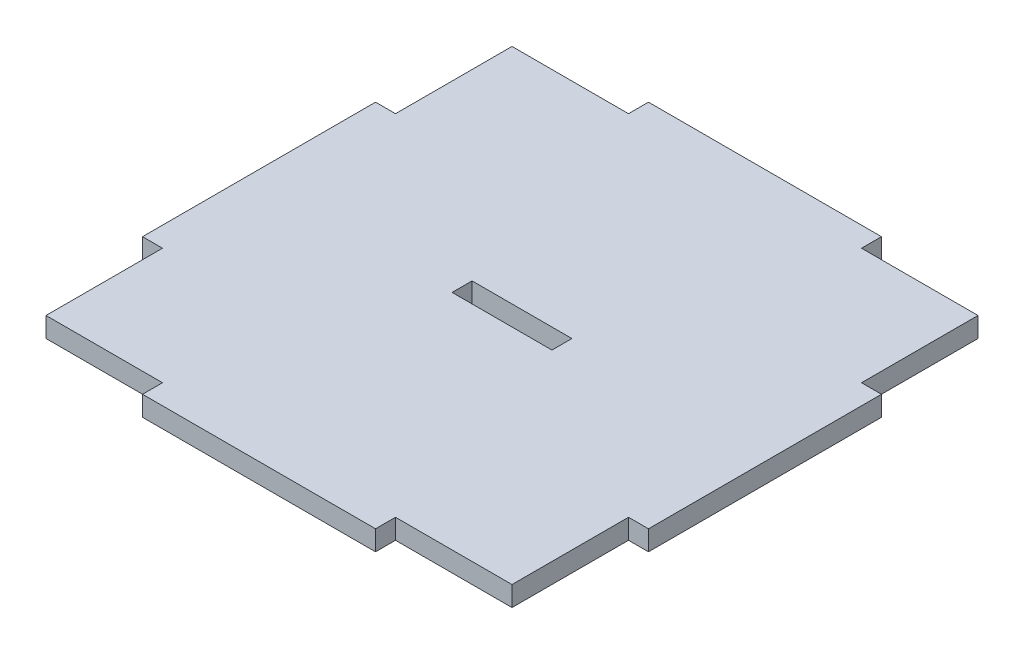
ISO-10303-21;
HEADER;
FILE_DESCRIPTION(('STEP AP214'),'2;1');
FILE_NAME('part.step','',(''),(''),'','','');
FILE_SCHEMA(('AUTOMOTIVE_DESIGN { 1 0 10303 214 1 1 1 1 }'));
ENDSEC;
DATA;
#1=APPLICATION_CONTEXT('core data for automotive mechanical design processes');
#2=APPLICATION_PROTOCOL_DEFINITION('international standard','automotive_design',2000,#1);
#3=PRODUCT_CONTEXT('',#1,'mechanical');
#4=PRODUCT('Part','Part','',(#3));
#5=PRODUCT_RELATED_PRODUCT_CATEGORY('part','',(#4));
#6=PRODUCT_DEFINITION_FORMATION('','',#4);
#7=PRODUCT_DEFINITION_CONTEXT('part definition',#1,'design');
#8=PRODUCT_DEFINITION('design','',#6,#7);
#9=PRODUCT_DEFINITION_SHAPE('','',#8);
#10=(LENGTH_UNIT() NAMED_UNIT(*) SI_UNIT(.MILLI.,.METRE.));
#11=(NAMED_UNIT(*) PLANE_ANGLE_UNIT() SI_UNIT($,.RADIAN.));
#12=(NAMED_UNIT(*) SI_UNIT($,.STERADIAN.) SOLID_ANGLE_UNIT());
#13=UNCERTAINTY_MEASURE_WITH_UNIT(LENGTH_MEASURE(1.E-05),#10,'distance_accuracy_value','');
#14=(GEOMETRIC_REPRESENTATION_CONTEXT(3) GLOBAL_UNCERTAINTY_ASSIGNED_CONTEXT((#13)) GLOBAL_UNIT_ASSIGNED_CONTEXT((#10,
#11,#12)) REPRESENTATION_CONTEXT('',''));
#15=CARTESIAN_POINT('',(0.,0.,0.));
#16=DIRECTION('',(0.,0.,1.));
#17=DIRECTION('',(1.,0.,0.));
#18=AXIS2_PLACEMENT_3D('',#15,#16,#17);
#19=CARTESIAN_POINT('',(35.,3.,-17.5));
#20=DIRECTION('',(-1.,0.,0.));
#21=DIRECTION('',(0.,0.,1.));
#22=AXIS2_PLACEMENT_3D('',#19,#20,#21);
#23=PLANE('',#22);
#24=DIRECTION('',(0.,0.,-1.));
#25=VECTOR('',#24,1.);
#26=CARTESIAN_POINT('',(35.,0.,-17.5));
#27=LINE('',#26,#25);
#28=CARTESIAN_POINT('',(35.,0.,-17.5));
#29=VERTEX_POINT('',#28);
#30=CARTESIAN_POINT('',(35.,0.,-35.));
#31=VERTEX_POINT('',#30);
#32=EDGE_CURVE('E243',#29,#31,#27,.T.);
#33=ORIENTED_EDGE('',*,*,#32,.T.);
#34=DIRECTION('',(0.,-1.,0.));
#35=VECTOR('',#34,1.);
#36=CARTESIAN_POINT('',(35.,3.,-35.));
#37=LINE('',#36,#35);
#38=CARTESIAN_POINT('',(35.,3.,-35.));
#39=VERTEX_POINT('',#38);
#40=EDGE_CURVE('E11',#39,#31,#37,.T.);
#41=ORIENTED_EDGE('',*,*,#40,.F.);
#42=DIRECTION('',(0.,0.,-1.));
#43=VECTOR('',#42,1.);
#44=CARTESIAN_POINT('',(35.,3.,-17.5));
#45=LINE('',#44,#43);
#46=CARTESIAN_POINT('',(35.,3.,-17.5));
#47=VERTEX_POINT('',#46);
#48=EDGE_CURVE('E249',#47,#39,#45,.T.);
#49=ORIENTED_EDGE('',*,*,#48,.F.);
#50=DIRECTION('',(0.,-1.,0.));
#51=VECTOR('',#50,1.);
#52=CARTESIAN_POINT('',(35.,3.,-17.5));
#53=LINE('',#52,#51);
#54=EDGE_CURVE('E311',#47,#29,#53,.T.);
#55=ORIENTED_EDGE('',*,*,#54,.T.);
#56=EDGE_LOOP('',(#33,#41,#49,#55));
#57=FACE_BOUND('',#56,.T.);
#58=ADVANCED_FACE('F39',(#57),#23,.F.);
#59=CARTESIAN_POINT('',(17.5,3.,-35.));
#60=DIRECTION('',(0.,0.,1.));
#61=DIRECTION('',(1.,0.,0.));
#62=AXIS2_PLACEMENT_3D('',#59,#60,#61);
#63=PLANE('',#62);
#64=DIRECTION('',(-1.,0.,0.));
#65=VECTOR('',#64,1.);
#66=CARTESIAN_POINT('',(17.5,0.,-35.));
#67=LINE('',#66,#65);
#68=CARTESIAN_POINT('',(17.5,0.,-35.));
#69=VERTEX_POINT('',#68);
#70=EDGE_CURVE('E315',#31,#69,#67,.T.);
#71=ORIENTED_EDGE('',*,*,#70,.T.);
#72=DIRECTION('',(0.,-1.,0.));
#73=VECTOR('',#72,1.);
#74=CARTESIAN_POINT('',(17.5,3.,-35.));
#75=LINE('',#74,#73);
#76=CARTESIAN_POINT('',(17.5,3.,-35.));
#77=VERTEX_POINT('',#76);
#78=EDGE_CURVE('E47',#77,#69,#75,.T.);
#79=ORIENTED_EDGE('',*,*,#78,.F.);
#80=DIRECTION('',(-1.,0.,0.));
#81=VECTOR('',#80,1.);
#82=CARTESIAN_POINT('',(17.5,3.,-35.));
#83=LINE('',#82,#81);
#84=EDGE_CURVE('E253',#39,#77,#83,.T.);
#85=ORIENTED_EDGE('',*,*,#84,.F.);
#86=ORIENTED_EDGE('',*,*,#40,.T.);
#87=EDGE_LOOP('',(#71,#79,#85,#86));
#88=FACE_BOUND('',#87,.T.);
#89=ADVANCED_FACE('F468',(#88),#63,.F.);
#90=CARTESIAN_POINT('',(17.5,3.,-38.));
#91=DIRECTION('',(-1.,0.,0.));
#92=DIRECTION('',(0.,0.,1.));
#93=AXIS2_PLACEMENT_3D('',#90,#91,#92);
#94=PLANE('',#93);
#95=DIRECTION('',(0.,0.,-1.));
#96=VECTOR('',#95,1.);
#97=CARTESIAN_POINT('',(17.5,0.,-38.));
#98=LINE('',#97,#96);
#99=CARTESIAN_POINT('',(17.5,0.,-38.));
#100=VERTEX_POINT('',#99);
#101=EDGE_CURVE('E318',#69,#100,#98,.T.);
#102=ORIENTED_EDGE('',*,*,#101,.T.);
#103=DIRECTION('',(0.,-1.,0.));
#104=VECTOR('',#103,1.);
#105=CARTESIAN_POINT('',(17.5,3.,-38.));
#106=LINE('',#105,#104);
#107=CARTESIAN_POINT('',(17.5,3.,-38.));
#108=VERTEX_POINT('',#107);
#109=EDGE_CURVE('E438',#108,#100,#106,.T.);
#110=ORIENTED_EDGE('',*,*,#109,.F.);
#111=DIRECTION('',(0.,0.,-1.));
#112=VECTOR('',#111,1.);
#113=CARTESIAN_POINT('',(17.5,3.,-38.));
#114=LINE('',#113,#112);
#115=EDGE_CURVE('E257',#77,#108,#114,.T.);
#116=ORIENTED_EDGE('',*,*,#115,.F.);
#117=ORIENTED_EDGE('',*,*,#78,.T.);
#118=EDGE_LOOP('',(#102,#110,#116,#117));
#119=FACE_BOUND('',#118,.T.);
#120=ADVANCED_FACE('F447',(#119),#94,.F.);
#121=CARTESIAN_POINT('',(-17.5,3.,-38.));
#122=DIRECTION('',(0.,0.,1.));
#123=DIRECTION('',(1.,0.,0.));
#124=AXIS2_PLACEMENT_3D('',#121,#122,#123);
#125=PLANE('',#124);
#126=DIRECTION('',(-1.,0.,0.));
#127=VECTOR('',#126,1.);
#128=CARTESIAN_POINT('',(-17.5,0.,-38.));
#129=LINE('',#128,#127);
#130=CARTESIAN_POINT('',(-17.5,0.,-38.));
#131=VERTEX_POINT('',#130);
#132=EDGE_CURVE('E321',#100,#131,#129,.T.);
#133=ORIENTED_EDGE('',*,*,#132,.T.);
#134=DIRECTION('',(0.,-1.,0.));
#135=VECTOR('',#134,1.);
#136=CARTESIAN_POINT('',(-17.5,3.,-38.));
#137=LINE('',#136,#135);
#138=CARTESIAN_POINT('',(-17.5,3.,-38.));
#139=VERTEX_POINT('',#138);
#140=EDGE_CURVE('E434',#139,#131,#137,.T.);
#141=ORIENTED_EDGE('',*,*,#140,.F.);
#142=DIRECTION('',(-1.,0.,0.));
#143=VECTOR('',#142,1.);
#144=CARTESIAN_POINT('',(-17.5,3.,-38.));
#145=LINE('',#144,#143);
#146=EDGE_CURVE('E260',#108,#139,#145,.T.);
#147=ORIENTED_EDGE('',*,*,#146,.F.);
#148=ORIENTED_EDGE('',*,*,#109,.T.);
#149=EDGE_LOOP('',(#133,#141,#147,#148));
#150=FACE_BOUND('',#149,.T.);
#151=ADVANCED_FACE('F456',(#150),#125,.F.);
#152=CARTESIAN_POINT('',(-17.5,3.,-38.));
#153=DIRECTION('',(1.,0.,0.));
#154=DIRECTION('',(0.,0.,-1.));
#155=AXIS2_PLACEMENT_3D('',#152,#153,#154);
#156=PLANE('',#155);
#157=DIRECTION('',(0.,0.,1.));
#158=VECTOR('',#157,1.);
#159=CARTESIAN_POINT('',(-17.5,0.,-38.));
#160=LINE('',#159,#158);
#161=CARTESIAN_POINT('',(-17.5,0.,-35.));
#162=VERTEX_POINT('',#161);
#163=EDGE_CURVE('E324',#131,#162,#160,.T.);
#164=ORIENTED_EDGE('',*,*,#163,.T.);
#165=DIRECTION('',(0.,-1.,0.));
#166=VECTOR('',#165,1.);
#167=CARTESIAN_POINT('',(-17.5,3.,-35.));
#168=LINE('',#167,#166);
#169=CARTESIAN_POINT('',(-17.5,3.,-35.));
#170=VERTEX_POINT('',#169);
#171=EDGE_CURVE('E430',#170,#162,#168,.T.);
#172=ORIENTED_EDGE('',*,*,#171,.F.);
#173=DIRECTION('',(0.,0.,1.));
#174=VECTOR('',#173,1.);
#175=CARTESIAN_POINT('',(-17.5,3.,-38.));
#176=LINE('',#175,#174);
#177=EDGE_CURVE('E263',#139,#170,#176,.T.);
#178=ORIENTED_EDGE('',*,*,#177,.F.);
#179=ORIENTED_EDGE('',*,*,#140,.T.);
#180=EDGE_LOOP('',(#164,#172,#178,#179));
#181=FACE_BOUND('',#180,.T.);
#182=ADVANCED_FACE('F460',(#181),#156,.F.);
#183=CARTESIAN_POINT('',(-35.,3.,-35.));
#184=DIRECTION('',(0.,0.,1.));
#185=DIRECTION('',(1.,0.,0.));
#186=AXIS2_PLACEMENT_3D('',#183,#184,#185);
#187=PLANE('',#186);
#188=DIRECTION('',(-1.,0.,0.));
#189=VECTOR('',#188,1.);
#190=CARTESIAN_POINT('',(-35.,0.,-35.));
#191=LINE('',#190,#189);
#192=CARTESIAN_POINT('',(-35.,0.,-35.));
#193=VERTEX_POINT('',#192);
#194=EDGE_CURVE('E327',#162,#193,#191,.T.);
#195=ORIENTED_EDGE('',*,*,#194,.T.);
#196=DIRECTION('',(0.,-1.,0.));
#197=VECTOR('',#196,1.);
#198=CARTESIAN_POINT('',(-35.,3.,-35.));
#199=LINE('',#198,#197);
#200=CARTESIAN_POINT('',(-35.,3.,-35.));
#201=VERTEX_POINT('',#200);
#202=EDGE_CURVE('E426',#201,#193,#199,.T.);
#203=ORIENTED_EDGE('',*,*,#202,.F.);
#204=DIRECTION('',(-1.,0.,0.));
#205=VECTOR('',#204,1.);
#206=CARTESIAN_POINT('',(-35.,3.,-35.));
#207=LINE('',#206,#205);
#208=EDGE_CURVE('E266',#170,#201,#207,.T.);
#209=ORIENTED_EDGE('',*,*,#208,.F.);
#210=ORIENTED_EDGE('',*,*,#171,.T.);
#211=EDGE_LOOP('',(#195,#203,#209,#210));
#212=FACE_BOUND('',#211,.T.);
#213=ADVANCED_FACE('F541',(#212),#187,.F.);
#214=CARTESIAN_POINT('',(-35.,3.,-17.5));
#215=DIRECTION('',(1.,0.,0.));
#216=DIRECTION('',(0.,0.,-1.));
#217=AXIS2_PLACEMENT_3D('',#214,#215,#216);
#218=PLANE('',#217);
#219=DIRECTION('',(0.,0.,1.));
#220=VECTOR('',#219,1.);
#221=CARTESIAN_POINT('',(-35.,0.,-17.5));
#222=LINE('',#221,#220);
#223=CARTESIAN_POINT('',(-35.,0.,-17.5));
#224=VERTEX_POINT('',#223);
#225=EDGE_CURVE('E330',#193,#224,#222,.T.);
#226=ORIENTED_EDGE('',*,*,#225,.T.);
#227=DIRECTION('',(0.,-1.,0.));
#228=VECTOR('',#227,1.);
#229=CARTESIAN_POINT('',(-35.,3.,-17.5));
#230=LINE('',#229,#228);
#231=CARTESIAN_POINT('',(-35.,3.,-17.5));
#232=VERTEX_POINT('',#231);
#233=EDGE_CURVE('E422',#232,#224,#230,.T.);
#234=ORIENTED_EDGE('',*,*,#233,.F.);
#235=DIRECTION('',(0.,0.,1.));
#236=VECTOR('',#235,1.);
#237=CARTESIAN_POINT('',(-35.,3.,-17.5));
#238=LINE('',#237,#236);
#239=EDGE_CURVE('E269',#201,#232,#238,.T.);
#240=ORIENTED_EDGE('',*,*,#239,.F.);
#241=ORIENTED_EDGE('',*,*,#202,.T.);
#242=EDGE_LOOP('',(#226,#234,#240,#241));
#243=FACE_BOUND('',#242,.T.);
#244=ADVANCED_FACE('F539',(#243),#218,.F.);
#245=CARTESIAN_POINT('',(-38.,3.,-17.5));
#246=DIRECTION('',(0.,0.,1.));
#247=DIRECTION('',(1.,0.,0.));
#248=AXIS2_PLACEMENT_3D('',#245,#246,#247);
#249=PLANE('',#248);
#250=DIRECTION('',(-1.,0.,0.));
#251=VECTOR('',#250,1.);
#252=CARTESIAN_POINT('',(-38.,0.,-17.5));
#253=LINE('',#252,#251);
#254=CARTESIAN_POINT('',(-38.,0.,-17.5));
#255=VERTEX_POINT('',#254);
#256=EDGE_CURVE('E333',#224,#255,#253,.T.);
#257=ORIENTED_EDGE('',*,*,#256,.T.);
#258=DIRECTION('',(0.,-1.,0.));
#259=VECTOR('',#258,1.);
#260=CARTESIAN_POINT('',(-38.,3.,-17.5));
#261=LINE('',#260,#259);
#262=CARTESIAN_POINT('',(-38.,3.,-17.5));
#263=VERTEX_POINT('',#262);
#264=EDGE_CURVE('E418',#263,#255,#261,.T.);
#265=ORIENTED_EDGE('',*,*,#264,.F.);
#266=DIRECTION('',(-1.,0.,0.));
#267=VECTOR('',#266,1.);
#268=CARTESIAN_POINT('',(-38.,3.,-17.5));
#269=LINE('',#268,#267);
#270=EDGE_CURVE('E272',#232,#263,#269,.T.);
#271=ORIENTED_EDGE('',*,*,#270,.F.);
#272=ORIENTED_EDGE('',*,*,#233,.T.);
#273=EDGE_LOOP('',(#257,#265,#271,#272));
#274=FACE_BOUND('',#273,.T.);
#275=ADVANCED_FACE('F534',(#274),#249,.F.);
#276=CARTESIAN_POINT('',(-38.,3.,17.5));
#277=DIRECTION('',(1.,0.,0.));
#278=DIRECTION('',(0.,0.,-1.));
#279=AXIS2_PLACEMENT_3D('',#276,#277,#278);
#280=PLANE('',#279);
#281=DIRECTION('',(0.,0.,1.));
#282=VECTOR('',#281,1.);
#283=CARTESIAN_POINT('',(-38.,0.,17.5));
#284=LINE('',#283,#282);
#285=CARTESIAN_POINT('',(-38.,0.,17.5));
#286=VERTEX_POINT('',#285);
#287=EDGE_CURVE('E336',#255,#286,#284,.T.);
#288=ORIENTED_EDGE('',*,*,#287,.T.);
#289=DIRECTION('',(0.,-1.,0.));
#290=VECTOR('',#289,1.);
#291=CARTESIAN_POINT('',(-38.,3.,17.5));
#292=LINE('',#291,#290);
#293=CARTESIAN_POINT('',(-38.,3.,17.5));
#294=VERTEX_POINT('',#293);
#295=EDGE_CURVE('E414',#294,#286,#292,.T.);
#296=ORIENTED_EDGE('',*,*,#295,.F.);
#297=DIRECTION('',(0.,0.,1.));
#298=VECTOR('',#297,1.);
#299=CARTESIAN_POINT('',(-38.,3.,17.5));
#300=LINE('',#299,#298);
#301=EDGE_CURVE('E275',#263,#294,#300,.T.);
#302=ORIENTED_EDGE('',*,*,#301,.F.);
#303=ORIENTED_EDGE('',*,*,#264,.T.);
#304=EDGE_LOOP('',(#288,#296,#302,#303));
#305=FACE_BOUND('',#304,.T.);
#306=ADVANCED_FACE('F529',(#305),#280,.F.);
#307=CARTESIAN_POINT('',(-38.,3.,17.5));
#308=DIRECTION('',(0.,0.,-1.));
#309=DIRECTION('',(-1.,0.,0.));
#310=AXIS2_PLACEMENT_3D('',#307,#308,#309);
#311=PLANE('',#310);
#312=DIRECTION('',(1.,0.,0.));
#313=VECTOR('',#312,1.);
#314=CARTESIAN_POINT('',(-38.,0.,17.5));
#315=LINE('',#314,#313);
#316=CARTESIAN_POINT('',(-35.,0.,17.5));
#317=VERTEX_POINT('',#316);
#318=EDGE_CURVE('E339',#286,#317,#315,.T.);
#319=ORIENTED_EDGE('',*,*,#318,.T.);
#320=DIRECTION('',(0.,-1.,0.));
#321=VECTOR('',#320,1.);
#322=CARTESIAN_POINT('',(-35.,3.,17.5));
#323=LINE('',#322,#321);
#324=CARTESIAN_POINT('',(-35.,3.,17.5));
#325=VERTEX_POINT('',#324);
#326=EDGE_CURVE('E410',#325,#317,#323,.T.);
#327=ORIENTED_EDGE('',*,*,#326,.F.);
#328=DIRECTION('',(1.,0.,0.));
#329=VECTOR('',#328,1.);
#330=CARTESIAN_POINT('',(-38.,3.,17.5));
#331=LINE('',#330,#329);
#332=EDGE_CURVE('E278',#294,#325,#331,.T.);
#333=ORIENTED_EDGE('',*,*,#332,.F.);
#334=ORIENTED_EDGE('',*,*,#295,.T.);
#335=EDGE_LOOP('',(#319,#327,#333,#334));
#336=FACE_BOUND('',#335,.T.);
#337=ADVANCED_FACE('F525',(#336),#311,.F.);
#338=CARTESIAN_POINT('',(-35.,3.,35.));
#339=DIRECTION('',(1.,0.,0.));
#340=DIRECTION('',(0.,0.,-1.));
#341=AXIS2_PLACEMENT_3D('',#338,#339,#340);
#342=PLANE('',#341);
#343=DIRECTION('',(0.,0.,1.));
#344=VECTOR('',#343,1.);
#345=CARTESIAN_POINT('',(-35.,0.,35.));
#346=LINE('',#345,#344);
#347=CARTESIAN_POINT('',(-35.,0.,35.));
#348=VERTEX_POINT('',#347);
#349=EDGE_CURVE('E342',#317,#348,#346,.T.);
#350=ORIENTED_EDGE('',*,*,#349,.T.);
#351=DIRECTION('',(0.,-1.,0.));
#352=VECTOR('',#351,1.);
#353=CARTESIAN_POINT('',(-35.,3.,35.));
#354=LINE('',#353,#352);
#355=CARTESIAN_POINT('',(-35.,3.,35.));
#356=VERTEX_POINT('',#355);
#357=EDGE_CURVE('E406',#356,#348,#354,.T.);
#358=ORIENTED_EDGE('',*,*,#357,.F.);
#359=DIRECTION('',(0.,0.,1.));
#360=VECTOR('',#359,1.);
#361=CARTESIAN_POINT('',(-35.,3.,35.));
#362=LINE('',#361,#360);
#363=EDGE_CURVE('E281',#325,#356,#362,.T.);
#364=ORIENTED_EDGE('',*,*,#363,.F.);
#365=ORIENTED_EDGE('',*,*,#326,.T.);
#366=EDGE_LOOP('',(#350,#358,#364,#365));
#367=FACE_BOUND('',#366,.T.);
#368=ADVANCED_FACE('F520',(#367),#342,.F.);
#369=CARTESIAN_POINT('',(-35.,3.,35.));
#370=DIRECTION('',(0.,0.,-1.));
#371=DIRECTION('',(-1.,0.,0.));
#372=AXIS2_PLACEMENT_3D('',#369,#370,#371);
#373=PLANE('',#372);
#374=DIRECTION('',(1.,0.,0.));
#375=VECTOR('',#374,1.);
#376=CARTESIAN_POINT('',(-35.,0.,35.));
#377=LINE('',#376,#375);
#378=CARTESIAN_POINT('',(-17.5,0.,35.));
#379=VERTEX_POINT('',#378);
#380=EDGE_CURVE('E345',#348,#379,#377,.T.);
#381=ORIENTED_EDGE('',*,*,#380,.T.);
#382=DIRECTION('',(0.,-1.,0.));
#383=VECTOR('',#382,1.);
#384=CARTESIAN_POINT('',(-17.5,3.,35.));
#385=LINE('',#384,#383);
#386=CARTESIAN_POINT('',(-17.5,3.,35.));
#387=VERTEX_POINT('',#386);
#388=EDGE_CURVE('E402',#387,#379,#385,.T.);
#389=ORIENTED_EDGE('',*,*,#388,.F.);
#390=DIRECTION('',(1.,0.,0.));
#391=VECTOR('',#390,1.);
#392=CARTESIAN_POINT('',(-35.,3.,35.));
#393=LINE('',#392,#391);
#394=EDGE_CURVE('E284',#356,#387,#393,.T.);
#395=ORIENTED_EDGE('',*,*,#394,.F.);
#396=ORIENTED_EDGE('',*,*,#357,.T.);
#397=EDGE_LOOP('',(#381,#389,#395,#396));
#398=FACE_BOUND('',#397,.T.);
#399=ADVANCED_FACE('F514',(#398),#373,.F.);
#400=CARTESIAN_POINT('',(-17.5,3.,38.));
#401=DIRECTION('',(1.,0.,0.));
#402=DIRECTION('',(0.,0.,-1.));
#403=AXIS2_PLACEMENT_3D('',#400,#401,#402);
#404=PLANE('',#403);
#405=DIRECTION('',(0.,0.,1.));
#406=VECTOR('',#405,1.);
#407=CARTESIAN_POINT('',(-17.5,0.,38.));
#408=LINE('',#407,#406);
#409=CARTESIAN_POINT('',(-17.5,0.,38.));
#410=VERTEX_POINT('',#409);
#411=EDGE_CURVE('E348',#379,#410,#408,.T.);
#412=ORIENTED_EDGE('',*,*,#411,.T.);
#413=DIRECTION('',(0.,-1.,0.));
#414=VECTOR('',#413,1.);
#415=CARTESIAN_POINT('',(-17.5,3.,38.));
#416=LINE('',#415,#414);
#417=CARTESIAN_POINT('',(-17.5,3.,38.));
#418=VERTEX_POINT('',#417);
#419=EDGE_CURVE('E398',#418,#410,#416,.T.);
#420=ORIENTED_EDGE('',*,*,#419,.F.);
#421=DIRECTION('',(0.,0.,1.));
#422=VECTOR('',#421,1.);
#423=CARTESIAN_POINT('',(-17.5,3.,38.));
#424=LINE('',#423,#422);
#425=EDGE_CURVE('E287',#387,#418,#424,.T.);
#426=ORIENTED_EDGE('',*,*,#425,.F.);
#427=ORIENTED_EDGE('',*,*,#388,.T.);
#428=EDGE_LOOP('',(#412,#420,#426,#427));
#429=FACE_BOUND('',#428,.T.);
#430=ADVANCED_FACE('F510',(#429),#404,.F.);
#431=CARTESIAN_POINT('',(-17.5,3.,38.));
#432=DIRECTION('',(0.,0.,-1.));
#433=DIRECTION('',(-1.,0.,0.));
#434=AXIS2_PLACEMENT_3D('',#431,#432,#433);
#435=PLANE('',#434);
#436=DIRECTION('',(1.,0.,0.));
#437=VECTOR('',#436,1.);
#438=CARTESIAN_POINT('',(-17.5,0.,38.));
#439=LINE('',#438,#437);
#440=CARTESIAN_POINT('',(17.5,0.,38.));
#441=VERTEX_POINT('',#440);
#442=EDGE_CURVE('E351',#410,#441,#439,.T.);
#443=ORIENTED_EDGE('',*,*,#442,.T.);
#444=DIRECTION('',(0.,-1.,0.));
#445=VECTOR('',#444,1.);
#446=CARTESIAN_POINT('',(17.5,3.,38.));
#447=LINE('',#446,#445);
#448=CARTESIAN_POINT('',(17.5,3.,38.));
#449=VERTEX_POINT('',#448);
#450=EDGE_CURVE('E394',#449,#441,#447,.T.);
#451=ORIENTED_EDGE('',*,*,#450,.F.);
#452=DIRECTION('',(1.,0.,0.));
#453=VECTOR('',#452,1.);
#454=CARTESIAN_POINT('',(-17.5,3.,38.));
#455=LINE('',#454,#453);
#456=EDGE_CURVE('E290',#418,#449,#455,.T.);
#457=ORIENTED_EDGE('',*,*,#456,.F.);
#458=ORIENTED_EDGE('',*,*,#419,.T.);
#459=EDGE_LOOP('',(#443,#451,#457,#458));
#460=FACE_BOUND('',#459,.T.);
#461=ADVANCED_FACE('F505',(#460),#435,.F.);
#462=CARTESIAN_POINT('',(17.5,3.,38.));
#463=DIRECTION('',(-1.,0.,0.));
#464=DIRECTION('',(0.,0.,1.));
#465=AXIS2_PLACEMENT_3D('',#462,#463,#464);
#466=PLANE('',#465);
#467=DIRECTION('',(0.,0.,-1.));
#468=VECTOR('',#467,1.);
#469=CARTESIAN_POINT('',(17.5,0.,38.));
#470=LINE('',#469,#468);
#471=CARTESIAN_POINT('',(17.5,0.,35.));
#472=VERTEX_POINT('',#471);
#473=EDGE_CURVE('E354',#441,#472,#470,.T.);
#474=ORIENTED_EDGE('',*,*,#473,.T.);
#475=DIRECTION('',(0.,-1.,0.));
#476=VECTOR('',#475,1.);
#477=CARTESIAN_POINT('',(17.5,3.,35.));
#478=LINE('',#477,#476);
#479=CARTESIAN_POINT('',(17.5,3.,35.));
#480=VERTEX_POINT('',#479);
#481=EDGE_CURVE('E390',#480,#472,#478,.T.);
#482=ORIENTED_EDGE('',*,*,#481,.F.);
#483=DIRECTION('',(0.,0.,-1.));
#484=VECTOR('',#483,1.);
#485=CARTESIAN_POINT('',(17.5,3.,38.));
#486=LINE('',#485,#484);
#487=EDGE_CURVE('E293',#449,#480,#486,.T.);
#488=ORIENTED_EDGE('',*,*,#487,.F.);
#489=ORIENTED_EDGE('',*,*,#450,.T.);
#490=EDGE_LOOP('',(#474,#482,#488,#489));
#491=FACE_BOUND('',#490,.T.);
#492=ADVANCED_FACE('F499',(#491),#466,.F.);
#493=CARTESIAN_POINT('',(17.5,3.,35.));
#494=DIRECTION('',(0.,0.,-1.));
#495=DIRECTION('',(-1.,0.,0.));
#496=AXIS2_PLACEMENT_3D('',#493,#494,#495);
#497=PLANE('',#496);
#498=DIRECTION('',(1.,0.,0.));
#499=VECTOR('',#498,1.);
#500=CARTESIAN_POINT('',(17.5,0.,35.));
#501=LINE('',#500,#499);
#502=CARTESIAN_POINT('',(35.,0.,35.));
#503=VERTEX_POINT('',#502);
#504=EDGE_CURVE('E357',#472,#503,#501,.T.);
#505=ORIENTED_EDGE('',*,*,#504,.T.);
#506=DIRECTION('',(0.,-1.,0.));
#507=VECTOR('',#506,1.);
#508=CARTESIAN_POINT('',(35.,3.,35.));
#509=LINE('',#508,#507);
#510=CARTESIAN_POINT('',(35.,3.,35.));
#511=VERTEX_POINT('',#510);
#512=EDGE_CURVE('E386',#511,#503,#509,.T.);
#513=ORIENTED_EDGE('',*,*,#512,.F.);
#514=DIRECTION('',(1.,0.,0.));
#515=VECTOR('',#514,1.);
#516=CARTESIAN_POINT('',(17.5,3.,35.));
#517=LINE('',#516,#515);
#518=EDGE_CURVE('E296',#480,#511,#517,.T.);
#519=ORIENTED_EDGE('',*,*,#518,.F.);
#520=ORIENTED_EDGE('',*,*,#481,.T.);
#521=EDGE_LOOP('',(#505,#513,#519,#520));
#522=FACE_BOUND('',#521,.T.);
#523=ADVANCED_FACE('F495',(#522),#497,.F.);
#524=CARTESIAN_POINT('',(35.,3.,35.));
#525=DIRECTION('',(-1.,0.,0.));
#526=DIRECTION('',(0.,0.,1.));
#527=AXIS2_PLACEMENT_3D('',#524,#525,#526);
#528=PLANE('',#527);
#529=DIRECTION('',(0.,0.,-1.));
#530=VECTOR('',#529,1.);
#531=CARTESIAN_POINT('',(35.,0.,35.));
#532=LINE('',#531,#530);
#533=CARTESIAN_POINT('',(35.,0.,17.5));
#534=VERTEX_POINT('',#533);
#535=EDGE_CURVE('E360',#503,#534,#532,.T.);
#536=ORIENTED_EDGE('',*,*,#535,.T.);
#537=DIRECTION('',(0.,-1.,0.));
#538=VECTOR('',#537,1.);
#539=CARTESIAN_POINT('',(35.,3.,17.5));
#540=LINE('',#539,#538);
#541=CARTESIAN_POINT('',(35.,3.,17.5));
#542=VERTEX_POINT('',#541);
#543=EDGE_CURVE('E382',#542,#534,#540,.T.);
#544=ORIENTED_EDGE('',*,*,#543,.F.);
#545=DIRECTION('',(0.,0.,-1.));
#546=VECTOR('',#545,1.);
#547=CARTESIAN_POINT('',(35.,3.,35.));
#548=LINE('',#547,#546);
#549=EDGE_CURVE('E299',#511,#542,#548,.T.);
#550=ORIENTED_EDGE('',*,*,#549,.F.);
#551=ORIENTED_EDGE('',*,*,#512,.T.);
#552=EDGE_LOOP('',(#536,#544,#550,#551));
#553=FACE_BOUND('',#552,.T.);
#554=ADVANCED_FACE('F490',(#553),#528,.F.);
#555=CARTESIAN_POINT('',(38.,3.,17.5));
#556=DIRECTION('',(0.,0.,-1.));
#557=DIRECTION('',(-1.,0.,0.));
#558=AXIS2_PLACEMENT_3D('',#555,#556,#557);
#559=PLANE('',#558);
#560=DIRECTION('',(1.,0.,0.));
#561=VECTOR('',#560,1.);
#562=CARTESIAN_POINT('',(38.,0.,17.5));
#563=LINE('',#562,#561);
#564=CARTESIAN_POINT('',(38.,0.,17.5));
#565=VERTEX_POINT('',#564);
#566=EDGE_CURVE('E363',#534,#565,#563,.T.);
#567=ORIENTED_EDGE('',*,*,#566,.T.);
#568=DIRECTION('',(0.,-1.,0.));
#569=VECTOR('',#568,1.);
#570=CARTESIAN_POINT('',(38.,3.,17.5));
#571=LINE('',#570,#569);
#572=CARTESIAN_POINT('',(38.,3.,17.5));
#573=VERTEX_POINT('',#572);
#574=EDGE_CURVE('E378',#573,#565,#571,.T.);
#575=ORIENTED_EDGE('',*,*,#574,.F.);
#576=DIRECTION('',(1.,0.,0.));
#577=VECTOR('',#576,1.);
#578=CARTESIAN_POINT('',(38.,3.,17.5));
#579=LINE('',#578,#577);
#580=EDGE_CURVE('E302',#542,#573,#579,.T.);
#581=ORIENTED_EDGE('',*,*,#580,.F.);
#582=ORIENTED_EDGE('',*,*,#543,.T.);
#583=EDGE_LOOP('',(#567,#575,#581,#582));
#584=FACE_BOUND('',#583,.T.);
#585=ADVANCED_FACE('F484',(#584),#559,.F.);
#586=CARTESIAN_POINT('',(38.,3.,-17.5));
#587=DIRECTION('',(-1.,0.,0.));
#588=DIRECTION('',(0.,0.,1.));
#589=AXIS2_PLACEMENT_3D('',#586,#587,#588);
#590=PLANE('',#589);
#591=DIRECTION('',(0.,0.,-1.));
#592=VECTOR('',#591,1.);
#593=CARTESIAN_POINT('',(38.,0.,-17.5));
#594=LINE('',#593,#592);
#595=CARTESIAN_POINT('',(38.,0.,-17.5));
#596=VERTEX_POINT('',#595);
#597=EDGE_CURVE('E366',#565,#596,#594,.T.);
#598=ORIENTED_EDGE('',*,*,#597,.T.);
#599=DIRECTION('',(0.,-1.,0.));
#600=VECTOR('',#599,1.);
#601=CARTESIAN_POINT('',(38.,3.,-17.5));
#602=LINE('',#601,#600);
#603=CARTESIAN_POINT('',(38.,3.,-17.5));
#604=VERTEX_POINT('',#603);
#605=EDGE_CURVE('E374',#604,#596,#602,.T.);
#606=ORIENTED_EDGE('',*,*,#605,.F.);
#607=DIRECTION('',(0.,0.,-1.));
#608=VECTOR('',#607,1.);
#609=CARTESIAN_POINT('',(38.,3.,-17.5));
#610=LINE('',#609,#608);
#611=EDGE_CURVE('E305',#573,#604,#610,.T.);
#612=ORIENTED_EDGE('',*,*,#611,.F.);
#613=ORIENTED_EDGE('',*,*,#574,.T.);
#614=EDGE_LOOP('',(#598,#606,#612,#613));
#615=FACE_BOUND('',#614,.T.);
#616=ADVANCED_FACE('F480',(#615),#590,.F.);
#617=CARTESIAN_POINT('',(38.,3.,-17.5));
#618=DIRECTION('',(0.,0.,1.));
#619=DIRECTION('',(1.,0.,0.));
#620=AXIS2_PLACEMENT_3D('',#617,#618,#619);
#621=PLANE('',#620);
#622=DIRECTION('',(-1.,0.,0.));
#623=VECTOR('',#622,1.);
#624=CARTESIAN_POINT('',(38.,0.,-17.5));
#625=LINE('',#624,#623);
#626=EDGE_CURVE('E254',#596,#29,#625,.T.);
#627=ORIENTED_EDGE('',*,*,#626,.T.);
#628=ORIENTED_EDGE('',*,*,#54,.F.);
#629=DIRECTION('',(-1.,0.,0.));
#630=VECTOR('',#629,1.);
#631=CARTESIAN_POINT('',(38.,3.,-17.5));
#632=LINE('',#631,#630);
#633=EDGE_CURVE('E308',#604,#47,#632,.T.);
#634=ORIENTED_EDGE('',*,*,#633,.F.);
#635=ORIENTED_EDGE('',*,*,#605,.T.);
#636=EDGE_LOOP('',(#627,#628,#634,#635));
#637=FACE_BOUND('',#636,.T.);
#638=ADVANCED_FACE('F475',(#637),#621,.F.);
#639=CARTESIAN_POINT('',(0.,3.,0.));
#640=DIRECTION('',(0.,-1.,0.));
#641=DIRECTION('',(0.,0.,-1.));
#642=AXIS2_PLACEMENT_3D('',#639,#640,#641);
#643=PLANE('',#642);
#644=DIRECTION('',(-1.,0.,0.));
#645=VECTOR('',#644,1.);
#646=CARTESIAN_POINT('',(-7.5,3.,-1.5));
#647=LINE('',#646,#645);
#648=CARTESIAN_POINT('',(7.5,3.,-1.5));
#649=VERTEX_POINT('',#648);
#650=CARTESIAN_POINT('',(-7.5,3.,-1.5));
#651=VERTEX_POINT('',#650);
#652=EDGE_CURVE('E234',#649,#651,#647,.T.);
#653=ORIENTED_EDGE('',*,*,#652,.F.);
#654=DIRECTION('',(0.,0.,-1.));
#655=VECTOR('',#654,1.);
#656=CARTESIAN_POINT('',(7.5,3.,1.5));
#657=LINE('',#656,#655);
#658=CARTESIAN_POINT('',(7.5,3.,1.5));
#659=VERTEX_POINT('',#658);
#660=EDGE_CURVE('E54',#659,#649,#657,.T.);
#661=ORIENTED_EDGE('',*,*,#660,.F.);
#662=DIRECTION('',(1.,0.,0.));
#663=VECTOR('',#662,1.);
#664=CARTESIAN_POINT('',(-7.5,3.,1.5));
#665=LINE('',#664,#663);
#666=CARTESIAN_POINT('',(-7.5,3.,1.5));
#667=VERTEX_POINT('',#666);
#668=EDGE_CURVE('E221',#667,#659,#665,.T.);
#669=ORIENTED_EDGE('',*,*,#668,.F.);
#670=DIRECTION('',(0.,0.,1.));
#671=VECTOR('',#670,1.);
#672=CARTESIAN_POINT('',(-7.5,3.,1.5));
#673=LINE('',#672,#671);
#674=EDGE_CURVE('E225',#651,#667,#673,.T.);
#675=ORIENTED_EDGE('',*,*,#674,.F.);
#676=EDGE_LOOP('',(#653,#661,#669,#675));
#677=FACE_BOUND('',#676,.T.);
#678=ORIENTED_EDGE('',*,*,#48,.T.);
#679=ORIENTED_EDGE('',*,*,#84,.T.);
#680=ORIENTED_EDGE('',*,*,#115,.T.);
#681=ORIENTED_EDGE('',*,*,#146,.T.);
#682=ORIENTED_EDGE('',*,*,#177,.T.);
#683=ORIENTED_EDGE('',*,*,#208,.T.);
#684=ORIENTED_EDGE('',*,*,#239,.T.);
#685=ORIENTED_EDGE('',*,*,#270,.T.);
#686=ORIENTED_EDGE('',*,*,#301,.T.);
#687=ORIENTED_EDGE('',*,*,#332,.T.);
#688=ORIENTED_EDGE('',*,*,#363,.T.);
#689=ORIENTED_EDGE('',*,*,#394,.T.);
#690=ORIENTED_EDGE('',*,*,#425,.T.);
#691=ORIENTED_EDGE('',*,*,#456,.T.);
#692=ORIENTED_EDGE('',*,*,#487,.T.);
#693=ORIENTED_EDGE('',*,*,#518,.T.);
#694=ORIENTED_EDGE('',*,*,#549,.T.);
#695=ORIENTED_EDGE('',*,*,#580,.T.);
#696=ORIENTED_EDGE('',*,*,#611,.T.);
#697=ORIENTED_EDGE('',*,*,#633,.T.);
#698=EDGE_LOOP('',(#678,#679,#680,#681,#682,#683,#684,#685,#686,#687,#688,#689,#690,#691,#692,
#693,#694,#695,#696,#697));
#699=FACE_BOUND('',#698,.T.);
#700=ADVANCED_FACE('F464',(#677,#699),#643,.F.);
#701=CARTESIAN_POINT('',(0.,0.,0.));
#702=DIRECTION('',(0.,-1.,0.));
#703=DIRECTION('',(0.,0.,-1.));
#704=AXIS2_PLACEMENT_3D('',#701,#702,#703);
#705=PLANE('',#704);
#706=DIRECTION('',(0.,0.,-1.));
#707=VECTOR('',#706,1.);
#708=CARTESIAN_POINT('',(7.5,0.,1.5));
#709=LINE('',#708,#707);
#710=CARTESIAN_POINT('',(7.5,0.,1.5));
#711=VERTEX_POINT('',#710);
#712=CARTESIAN_POINT('',(7.5,0.,-1.5));
#713=VERTEX_POINT('',#712);
#714=EDGE_CURVE('E202',#711,#713,#709,.T.);
#715=ORIENTED_EDGE('',*,*,#714,.T.);
#716=DIRECTION('',(-1.,0.,0.));
#717=VECTOR('',#716,1.);
#718=CARTESIAN_POINT('',(-7.5,0.,-1.5));
#719=LINE('',#718,#717);
#720=CARTESIAN_POINT('',(-7.5,0.,-1.5));
#721=VERTEX_POINT('',#720);
#722=EDGE_CURVE('E212',#713,#721,#719,.T.);
#723=ORIENTED_EDGE('',*,*,#722,.T.);
#724=DIRECTION('',(0.,0.,1.));
#725=VECTOR('',#724,1.);
#726=CARTESIAN_POINT('',(-7.5,0.,1.5));
#727=LINE('',#726,#725);
#728=CARTESIAN_POINT('',(-7.5,0.,1.5));
#729=VERTEX_POINT('',#728);
#730=EDGE_CURVE('E62',#721,#729,#727,.T.);
#731=ORIENTED_EDGE('',*,*,#730,.T.);
#732=DIRECTION('',(1.,0.,0.));
#733=VECTOR('',#732,1.);
#734=CARTESIAN_POINT('',(-7.5,0.,1.5));
#735=LINE('',#734,#733);
#736=EDGE_CURVE('E209',#729,#711,#735,.T.);
#737=ORIENTED_EDGE('',*,*,#736,.T.);
#738=EDGE_LOOP('',(#715,#723,#731,#737));
#739=FACE_BOUND('',#738,.T.);
#740=ORIENTED_EDGE('',*,*,#32,.F.);
#741=ORIENTED_EDGE('',*,*,#626,.F.);
#742=ORIENTED_EDGE('',*,*,#597,.F.);
#743=ORIENTED_EDGE('',*,*,#566,.F.);
#744=ORIENTED_EDGE('',*,*,#535,.F.);
#745=ORIENTED_EDGE('',*,*,#504,.F.);
#746=ORIENTED_EDGE('',*,*,#473,.F.);
#747=ORIENTED_EDGE('',*,*,#442,.F.);
#748=ORIENTED_EDGE('',*,*,#411,.F.);
#749=ORIENTED_EDGE('',*,*,#380,.F.);
#750=ORIENTED_EDGE('',*,*,#349,.F.);
#751=ORIENTED_EDGE('',*,*,#318,.F.);
#752=ORIENTED_EDGE('',*,*,#287,.F.);
#753=ORIENTED_EDGE('',*,*,#256,.F.);
#754=ORIENTED_EDGE('',*,*,#225,.F.);
#755=ORIENTED_EDGE('',*,*,#194,.F.);
#756=ORIENTED_EDGE('',*,*,#163,.F.);
#757=ORIENTED_EDGE('',*,*,#132,.F.);
#758=ORIENTED_EDGE('',*,*,#101,.F.);
#759=ORIENTED_EDGE('',*,*,#70,.F.);
#760=EDGE_LOOP('',(#740,#741,#742,#743,#744,#745,#746,#747,#748,#749,#750,#751,#752,#753,#754,
#755,#756,#757,#758,#759));
#761=FACE_BOUND('',#760,.T.);
#762=ADVANCED_FACE('F217',(#739,#761),#705,.T.);
#763=CARTESIAN_POINT('',(7.5,0.,1.5));
#764=DIRECTION('',(1.,0.,0.));
#765=DIRECTION('',(0.,0.,-1.));
#766=AXIS2_PLACEMENT_3D('',#763,#764,#765);
#767=PLANE('',#766);
#768=ORIENTED_EDGE('',*,*,#660,.T.);
#769=DIRECTION('',(0.,1.,0.));
#770=VECTOR('',#769,1.);
#771=CARTESIAN_POINT('',(7.5,0.,-1.5));
#772=LINE('',#771,#770);
#773=EDGE_CURVE('E198',#713,#649,#772,.T.);
#774=ORIENTED_EDGE('',*,*,#773,.F.);
#775=ORIENTED_EDGE('',*,*,#714,.F.);
#776=DIRECTION('',(0.,1.,0.));
#777=VECTOR('',#776,1.);
#778=CARTESIAN_POINT('',(7.5,0.,1.5));
#779=LINE('',#778,#777);
#780=EDGE_CURVE('E240',#711,#659,#779,.T.);
#781=ORIENTED_EDGE('',*,*,#780,.T.);
#782=EDGE_LOOP('',(#768,#774,#775,#781));
#783=FACE_BOUND('',#782,.T.);
#784=ADVANCED_FACE('F200',(#783),#767,.F.);
#785=CARTESIAN_POINT('',(-7.5,0.,1.5));
#786=DIRECTION('',(0.,0.,1.));
#787=DIRECTION('',(1.,0.,0.));
#788=AXIS2_PLACEMENT_3D('',#785,#786,#787);
#789=PLANE('',#788);
#790=ORIENTED_EDGE('',*,*,#668,.T.);
#791=ORIENTED_EDGE('',*,*,#780,.F.);
#792=ORIENTED_EDGE('',*,*,#736,.F.);
#793=DIRECTION('',(0.,1.,0.));
#794=VECTOR('',#793,1.);
#795=CARTESIAN_POINT('',(-7.5,0.,1.5));
#796=LINE('',#795,#794);
#797=EDGE_CURVE('E244',#729,#667,#796,.T.);
#798=ORIENTED_EDGE('',*,*,#797,.T.);
#799=EDGE_LOOP('',(#790,#791,#792,#798));
#800=FACE_BOUND('',#799,.T.);
#801=ADVANCED_FACE('F704',(#800),#789,.F.);
#802=CARTESIAN_POINT('',(-7.5,0.,1.5));
#803=DIRECTION('',(-1.,0.,0.));
#804=DIRECTION('',(0.,0.,1.));
#805=AXIS2_PLACEMENT_3D('',#802,#803,#804);
#806=PLANE('',#805);
#807=ORIENTED_EDGE('',*,*,#674,.T.);
#808=ORIENTED_EDGE('',*,*,#797,.F.);
#809=ORIENTED_EDGE('',*,*,#730,.F.);
#810=DIRECTION('',(0.,1.,0.));
#811=VECTOR('',#810,1.);
#812=CARTESIAN_POINT('',(-7.5,0.,-1.5));
#813=LINE('',#812,#811);
#814=EDGE_CURVE('E208',#721,#651,#813,.T.);
#815=ORIENTED_EDGE('',*,*,#814,.T.);
#816=EDGE_LOOP('',(#807,#808,#809,#815));
#817=FACE_BOUND('',#816,.T.);
#818=ADVANCED_FACE('F713',(#817),#806,.F.);
#819=CARTESIAN_POINT('',(-7.5,0.,-1.5));
#820=DIRECTION('',(0.,0.,-1.));
#821=DIRECTION('',(-1.,0.,0.));
#822=AXIS2_PLACEMENT_3D('',#819,#820,#821);
#823=PLANE('',#822);
#824=ORIENTED_EDGE('',*,*,#652,.T.);
#825=ORIENTED_EDGE('',*,*,#814,.F.);
#826=ORIENTED_EDGE('',*,*,#722,.F.);
#827=ORIENTED_EDGE('',*,*,#773,.T.);
#828=EDGE_LOOP('',(#824,#825,#826,#827));
#829=FACE_BOUND('',#828,.T.);
#830=ADVANCED_FACE('F213',(#829),#823,.F.);
#831=CLOSED_SHELL('',(#58,#89,#120,#151,#182,#213,#244,#275,#306,#337,#368,#399,#430,#461,#492,
#523,#554,#585,#616,#638,#700,#762,#784,#801,#818,#830));
#832=MANIFOLD_SOLID_BREP('B2',#831);
#833=ADVANCED_BREP_SHAPE_REPRESENTATION('',(#18,#832),#14);
#834=SHAPE_DEFINITION_REPRESENTATION(#9,#833);
ENDSEC;
END-ISO-10303-21;
